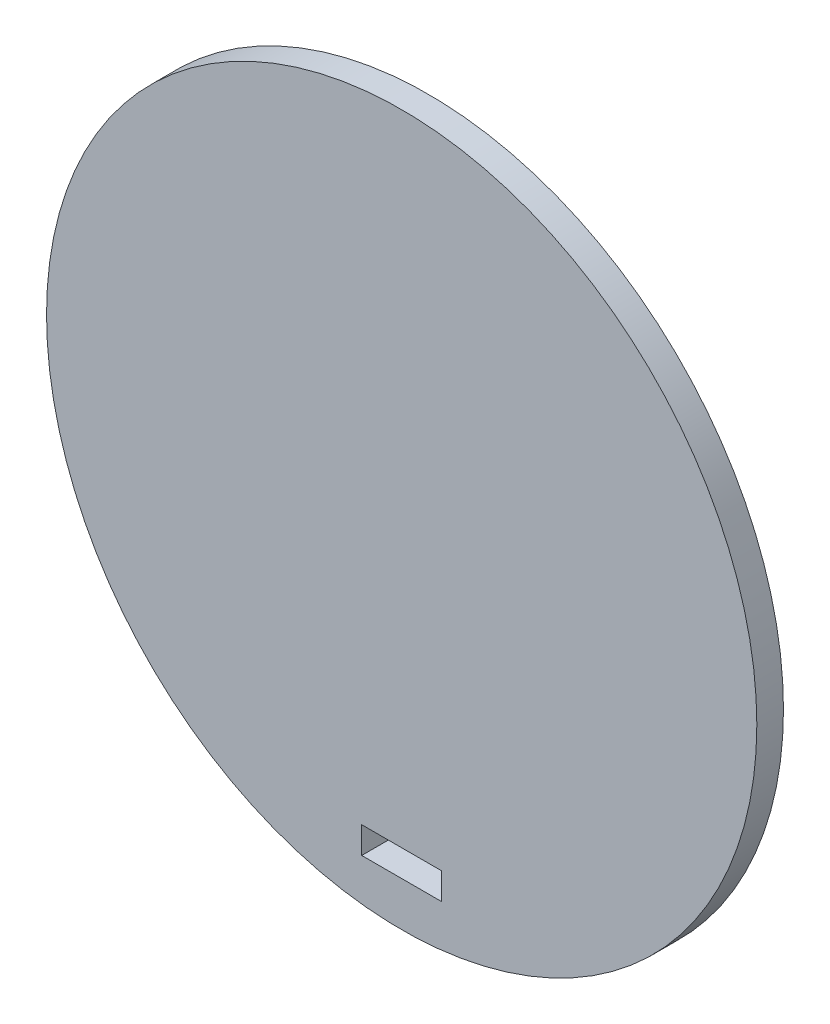
ISO-10303-21;
HEADER;
FILE_DESCRIPTION(('STEP AP214'),'2;1');
FILE_NAME('part.step','',(''),(''),'','','');
FILE_SCHEMA(('AUTOMOTIVE_DESIGN { 1 0 10303 214 1 1 1 1 }'));
ENDSEC;
DATA;
#1=APPLICATION_CONTEXT('core data for automotive mechanical design processes');
#2=APPLICATION_PROTOCOL_DEFINITION('international standard','automotive_design',2000,#1);
#3=PRODUCT_CONTEXT('',#1,'mechanical');
#4=PRODUCT('Part','Part','',(#3));
#5=PRODUCT_RELATED_PRODUCT_CATEGORY('part','',(#4));
#6=PRODUCT_DEFINITION_FORMATION('','',#4);
#7=PRODUCT_DEFINITION_CONTEXT('part definition',#1,'design');
#8=PRODUCT_DEFINITION('design','',#6,#7);
#9=PRODUCT_DEFINITION_SHAPE('','',#8);
#10=(LENGTH_UNIT() NAMED_UNIT(*) SI_UNIT(.MILLI.,.METRE.));
#11=(NAMED_UNIT(*) PLANE_ANGLE_UNIT() SI_UNIT($,.RADIAN.));
#12=(NAMED_UNIT(*) SI_UNIT($,.STERADIAN.) SOLID_ANGLE_UNIT());
#13=UNCERTAINTY_MEASURE_WITH_UNIT(LENGTH_MEASURE(1.E-05),#10,'distance_accuracy_value','');
#14=(GEOMETRIC_REPRESENTATION_CONTEXT(3) GLOBAL_UNCERTAINTY_ASSIGNED_CONTEXT((#13)) GLOBAL_UNIT_ASSIGNED_CONTEXT((#10,
#11,#12)) REPRESENTATION_CONTEXT('',''));
#15=CARTESIAN_POINT('',(0.,0.,0.));
#16=DIRECTION('',(0.,0.,1.));
#17=DIRECTION('',(1.,0.,0.));
#18=AXIS2_PLACEMENT_3D('',#15,#16,#17);
#19=CARTESIAN_POINT('',(0.,0.,3.));
#20=DIRECTION('',(0.,0.,1.));
#21=DIRECTION('',(1.,0.,0.));
#22=AXIS2_PLACEMENT_3D('',#19,#20,#21);
#23=PLANE('',#22);
#24=CARTESIAN_POINT('',(0.,0.,3.));
#25=DIRECTION('',(0.,0.,1.));
#26=DIRECTION('',(1.,0.,0.));
#27=AXIS2_PLACEMENT_3D('',#24,#25,#26);
#28=CIRCLE('',#27,40.);
#29=CARTESIAN_POINT('',(40.,0.,3.));
#30=VERTEX_POINT('',#29);
#31=EDGE_CURVE('E11',#30,#30,#28,.T.);
#32=ORIENTED_EDGE('',*,*,#31,.T.);
#33=EDGE_LOOP('',(#32));
#34=FACE_BOUND('',#33,.T.);
#35=DIRECTION('',(0.,1.,0.));
#36=VECTOR('',#35,1.);
#37=CARTESIAN_POINT('',(-4.5,0.,3.));
#38=LINE('',#37,#36);
#39=CARTESIAN_POINT('',(-4.5,-35.,3.));
#40=VERTEX_POINT('',#39);
#41=CARTESIAN_POINT('',(-4.5,-32.,3.));
#42=VERTEX_POINT('',#41);
#43=EDGE_CURVE('E88',#40,#42,#38,.T.);
#44=ORIENTED_EDGE('',*,*,#43,.T.);
#45=DIRECTION('',(-1.,0.,0.));
#46=VECTOR('',#45,1.);
#47=CARTESIAN_POINT('',(0.,-32.,3.));
#48=LINE('',#47,#46);
#49=CARTESIAN_POINT('',(4.5,-32.,3.));
#50=VERTEX_POINT('',#49);
#51=EDGE_CURVE('E84',#50,#42,#48,.T.);
#52=ORIENTED_EDGE('',*,*,#51,.F.);
#53=DIRECTION('',(0.,1.,0.));
#54=VECTOR('',#53,1.);
#55=CARTESIAN_POINT('',(4.5,0.,3.));
#56=LINE('',#55,#54);
#57=CARTESIAN_POINT('',(4.5,-35.,3.));
#58=VERTEX_POINT('',#57);
#59=EDGE_CURVE('E76',#58,#50,#56,.T.);
#60=ORIENTED_EDGE('',*,*,#59,.F.);
#61=DIRECTION('',(-1.,0.,0.));
#62=VECTOR('',#61,1.);
#63=CARTESIAN_POINT('',(0.,-35.,3.));
#64=LINE('',#63,#62);
#65=EDGE_CURVE('E50',#58,#40,#64,.T.);
#66=ORIENTED_EDGE('',*,*,#65,.T.);
#67=EDGE_LOOP('',(#44,#52,#60,#66));
#68=FACE_BOUND('',#67,.T.);
#69=ADVANCED_FACE('F35',(#34,#68),#23,.T.);
#70=CARTESIAN_POINT('',(0.,0.,0.));
#71=DIRECTION('',(0.,0.,1.));
#72=DIRECTION('',(1.,0.,0.));
#73=AXIS2_PLACEMENT_3D('',#70,#71,#72);
#74=PLANE('',#73);
#75=CARTESIAN_POINT('',(0.,0.,0.));
#76=DIRECTION('',(0.,0.,1.));
#77=DIRECTION('',(1.,0.,0.));
#78=AXIS2_PLACEMENT_3D('',#75,#76,#77);
#79=CIRCLE('',#78,40.);
#80=CARTESIAN_POINT('',(40.,0.,0.));
#81=VERTEX_POINT('',#80);
#82=EDGE_CURVE('E39',#81,#81,#79,.T.);
#83=ORIENTED_EDGE('',*,*,#82,.F.);
#84=EDGE_LOOP('',(#83));
#85=FACE_BOUND('',#84,.T.);
#86=DIRECTION('',(-1.,0.,0.));
#87=VECTOR('',#86,1.);
#88=CARTESIAN_POINT('',(0.,-32.,0.));
#89=LINE('',#88,#87);
#90=CARTESIAN_POINT('',(4.5,-32.,0.));
#91=VERTEX_POINT('',#90);
#92=CARTESIAN_POINT('',(-4.5,-32.,0.));
#93=VERTEX_POINT('',#92);
#94=EDGE_CURVE('E58',#91,#93,#89,.T.);
#95=ORIENTED_EDGE('',*,*,#94,.T.);
#96=DIRECTION('',(0.,1.,0.));
#97=VECTOR('',#96,1.);
#98=CARTESIAN_POINT('',(-4.5,0.,0.));
#99=LINE('',#98,#97);
#100=CARTESIAN_POINT('',(-4.5,-35.,0.));
#101=VERTEX_POINT('',#100);
#102=EDGE_CURVE('E92',#101,#93,#99,.T.);
#103=ORIENTED_EDGE('',*,*,#102,.F.);
#104=DIRECTION('',(-1.,0.,0.));
#105=VECTOR('',#104,1.);
#106=CARTESIAN_POINT('',(0.,-35.,0.));
#107=LINE('',#106,#105);
#108=CARTESIAN_POINT('',(4.5,-35.,0.));
#109=VERTEX_POINT('',#108);
#110=EDGE_CURVE('E95',#109,#101,#107,.T.);
#111=ORIENTED_EDGE('',*,*,#110,.F.);
#112=DIRECTION('',(0.,1.,0.));
#113=VECTOR('',#112,1.);
#114=CARTESIAN_POINT('',(4.5,0.,0.));
#115=LINE('',#114,#113);
#116=EDGE_CURVE('E101',#109,#91,#115,.T.);
#117=ORIENTED_EDGE('',*,*,#116,.T.);
#118=EDGE_LOOP('',(#95,#103,#111,#117));
#119=FACE_BOUND('',#118,.T.);
#120=ADVANCED_FACE('F113',(#85,#119),#74,.F.);
#121=CARTESIAN_POINT('',(0.,0.,3.));
#122=DIRECTION('',(0.,0.,-1.));
#123=DIRECTION('',(-1.,0.,0.));
#124=AXIS2_PLACEMENT_3D('',#121,#122,#123);
#125=CYLINDRICAL_SURFACE('',#124,40.);
#126=ORIENTED_EDGE('',*,*,#31,.F.);
#127=EDGE_LOOP('',(#126));
#128=FACE_BOUND('',#127,.T.);
#129=ORIENTED_EDGE('',*,*,#82,.T.);
#130=EDGE_LOOP('',(#129));
#131=FACE_BOUND('',#130,.T.);
#132=ADVANCED_FACE('F37',(#128,#131),#125,.T.);
#133=CARTESIAN_POINT('',(0.,-32.,3.));
#134=DIRECTION('',(0.,-1.,0.));
#135=DIRECTION('',(0.,0.,-1.));
#136=AXIS2_PLACEMENT_3D('',#133,#134,#135);
#137=PLANE('',#136);
#138=ORIENTED_EDGE('',*,*,#94,.F.);
#139=DIRECTION('',(0.,0.,-1.));
#140=VECTOR('',#139,1.);
#141=CARTESIAN_POINT('',(4.5,-32.,3.));
#142=LINE('',#141,#140);
#143=EDGE_CURVE('E79',#50,#91,#142,.T.);
#144=ORIENTED_EDGE('',*,*,#143,.F.);
#145=ORIENTED_EDGE('',*,*,#51,.T.);
#146=DIRECTION('',(0.,0.,-1.));
#147=VECTOR('',#146,1.);
#148=CARTESIAN_POINT('',(-4.5,-32.,3.));
#149=LINE('',#148,#147);
#150=EDGE_CURVE('E105',#42,#93,#149,.T.);
#151=ORIENTED_EDGE('',*,*,#150,.T.);
#152=EDGE_LOOP('',(#138,#144,#145,#151));
#153=FACE_BOUND('',#152,.T.);
#154=ADVANCED_FACE('F86',(#153),#137,.T.);
#155=CARTESIAN_POINT('',(-4.5,0.,3.));
#156=DIRECTION('',(-1.,0.,0.));
#157=DIRECTION('',(0.,0.,1.));
#158=AXIS2_PLACEMENT_3D('',#155,#156,#157);
#159=PLANE('',#158);
#160=ORIENTED_EDGE('',*,*,#102,.T.);
#161=ORIENTED_EDGE('',*,*,#150,.F.);
#162=ORIENTED_EDGE('',*,*,#43,.F.);
#163=DIRECTION('',(0.,0.,-1.));
#164=VECTOR('',#163,1.);
#165=CARTESIAN_POINT('',(-4.5,-35.,3.));
#166=LINE('',#165,#164);
#167=EDGE_CURVE('E107',#40,#101,#166,.T.);
#168=ORIENTED_EDGE('',*,*,#167,.T.);
#169=EDGE_LOOP('',(#160,#161,#162,#168));
#170=FACE_BOUND('',#169,.T.);
#171=ADVANCED_FACE('F115',(#170),#159,.F.);
#172=CARTESIAN_POINT('',(0.,-35.,3.));
#173=DIRECTION('',(0.,-1.,0.));
#174=DIRECTION('',(0.,0.,-1.));
#175=AXIS2_PLACEMENT_3D('',#172,#173,#174);
#176=PLANE('',#175);
#177=ORIENTED_EDGE('',*,*,#110,.T.);
#178=ORIENTED_EDGE('',*,*,#167,.F.);
#179=ORIENTED_EDGE('',*,*,#65,.F.);
#180=DIRECTION('',(0.,0.,-1.));
#181=VECTOR('',#180,1.);
#182=CARTESIAN_POINT('',(4.5,-35.,3.));
#183=LINE('',#182,#181);
#184=EDGE_CURVE('E81',#58,#109,#183,.T.);
#185=ORIENTED_EDGE('',*,*,#184,.T.);
#186=EDGE_LOOP('',(#177,#178,#179,#185));
#187=FACE_BOUND('',#186,.T.);
#188=ADVANCED_FACE('F109',(#187),#176,.F.);
#189=CARTESIAN_POINT('',(4.5,0.,3.));
#190=DIRECTION('',(-1.,0.,0.));
#191=DIRECTION('',(0.,0.,1.));
#192=AXIS2_PLACEMENT_3D('',#189,#190,#191);
#193=PLANE('',#192);
#194=ORIENTED_EDGE('',*,*,#116,.F.);
#195=ORIENTED_EDGE('',*,*,#184,.F.);
#196=ORIENTED_EDGE('',*,*,#59,.T.);
#197=ORIENTED_EDGE('',*,*,#143,.T.);
#198=EDGE_LOOP('',(#194,#195,#196,#197));
#199=FACE_BOUND('',#198,.T.);
#200=ADVANCED_FACE('F78',(#199),#193,.T.);
#201=CLOSED_SHELL('',(#69,#120,#132,#154,#171,#188,#200));
#202=MANIFOLD_SOLID_BREP('B2',#201);
#203=ADVANCED_BREP_SHAPE_REPRESENTATION('',(#18,#202),#14);
#204=SHAPE_DEFINITION_REPRESENTATION(#9,#203);
ENDSEC;
END-ISO-10303-21;
